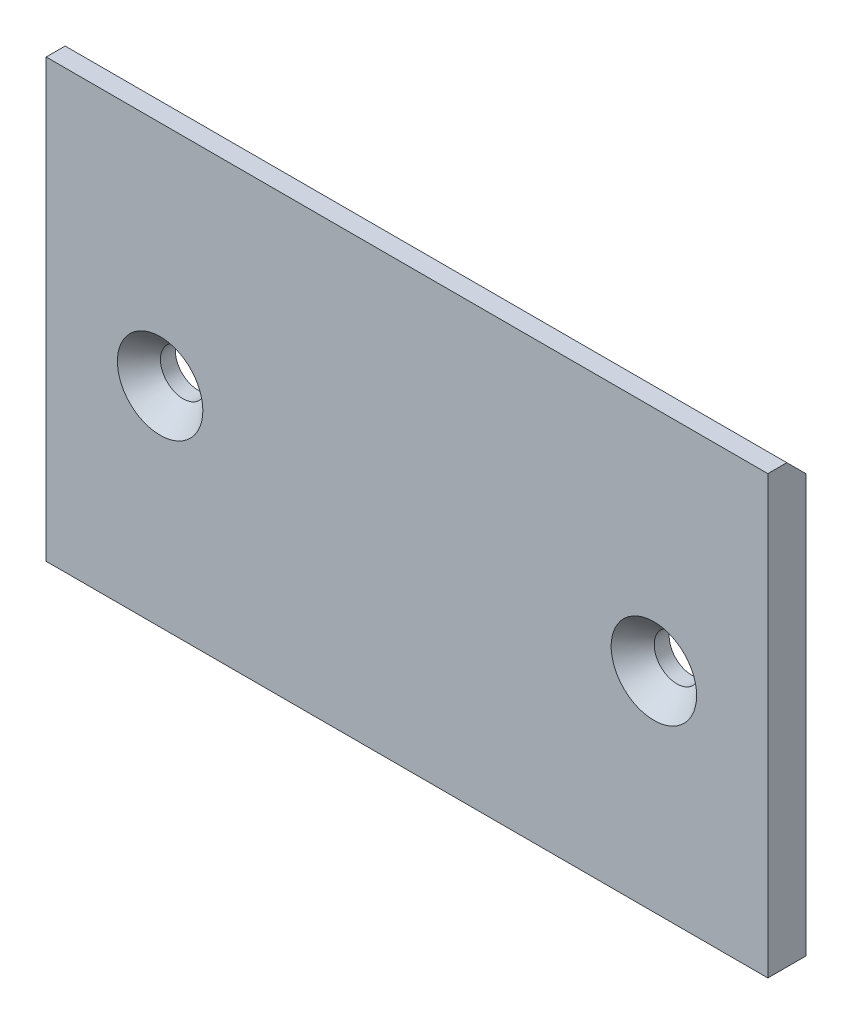
ISO-10303-21;
HEADER;
FILE_DESCRIPTION(('STEP AP214'),'2;1');
FILE_NAME('part.step','',(''),(''),'','','');
FILE_SCHEMA(('AUTOMOTIVE_DESIGN { 1 0 10303 214 1 1 1 1 }'));
ENDSEC;
DATA;
#1=APPLICATION_CONTEXT('core data for automotive mechanical design processes');
#2=APPLICATION_PROTOCOL_DEFINITION('international standard','automotive_design',2000,#1);
#3=PRODUCT_CONTEXT('',#1,'mechanical');
#4=PRODUCT('Part','Part','',(#3));
#5=PRODUCT_RELATED_PRODUCT_CATEGORY('part','',(#4));
#6=PRODUCT_DEFINITION_FORMATION('','',#4);
#7=PRODUCT_DEFINITION_CONTEXT('part definition',#1,'design');
#8=PRODUCT_DEFINITION('design','',#6,#7);
#9=PRODUCT_DEFINITION_SHAPE('','',#8);
#10=(LENGTH_UNIT() NAMED_UNIT(*) SI_UNIT(.MILLI.,.METRE.));
#11=(NAMED_UNIT(*) PLANE_ANGLE_UNIT() SI_UNIT($,.RADIAN.));
#12=(NAMED_UNIT(*) SI_UNIT($,.STERADIAN.) SOLID_ANGLE_UNIT());
#13=UNCERTAINTY_MEASURE_WITH_UNIT(LENGTH_MEASURE(1.E-05),#10,'distance_accuracy_value','');
#14=(GEOMETRIC_REPRESENTATION_CONTEXT(3) GLOBAL_UNCERTAINTY_ASSIGNED_CONTEXT((#13)) GLOBAL_UNIT_ASSIGNED_CONTEXT((#10,
#11,#12)) REPRESENTATION_CONTEXT('',''));
#15=CARTESIAN_POINT('',(0.,0.,0.));
#16=DIRECTION('',(0.,0.,1.));
#17=DIRECTION('',(1.,0.,0.));
#18=AXIS2_PLACEMENT_3D('',#15,#16,#17);
#19=CARTESIAN_POINT('',(-30.1625,18.25625,1.5875));
#20=DIRECTION('',(1.,0.,0.));
#21=DIRECTION('',(0.,1.,0.));
#22=AXIS2_PLACEMENT_3D('',#19,#20,#21);
#23=PLANE('',#22);
#24=DIRECTION('',(0.,0.,-1.));
#25=VECTOR('',#24,1.);
#26=CARTESIAN_POINT('',(-30.1625,18.25625,1.5875));
#27=LINE('',#26,#25);
#28=CARTESIAN_POINT('',(-30.1625,18.25625,1.5875));
#29=VERTEX_POINT('',#28);
#30=CARTESIAN_POINT('',(-30.1625,18.25625,0.));
#31=VERTEX_POINT('',#30);
#32=EDGE_CURVE('E127',#29,#31,#27,.T.);
#33=ORIENTED_EDGE('',*,*,#32,.T.);
#34=DIRECTION('',(0.,0.707106781186549,0.707106781186546));
#35=VECTOR('',#34,1.);
#36=CARTESIAN_POINT('',(-30.1625,18.25625,0.));
#37=LINE('',#36,#35);
#38=CARTESIAN_POINT('',(-30.1625,16.66875,-1.5875));
#39=VERTEX_POINT('',#38);
#40=EDGE_CURVE('E56',#31,#39,#37,.F.);
#41=ORIENTED_EDGE('',*,*,#40,.T.);
#42=DIRECTION('',(0.,-1.,0.));
#43=VECTOR('',#42,1.);
#44=CARTESIAN_POINT('',(-30.1625,18.25625,-1.5875));
#45=LINE('',#44,#43);
#46=CARTESIAN_POINT('',(-30.1625,-18.25625,-1.5875));
#47=VERTEX_POINT('',#46);
#48=EDGE_CURVE('E99',#39,#47,#45,.T.);
#49=ORIENTED_EDGE('',*,*,#48,.T.);
#50=DIRECTION('',(0.,0.,-1.));
#51=VECTOR('',#50,1.);
#52=CARTESIAN_POINT('',(-30.1625,-18.25625,1.5875));
#53=LINE('',#52,#51);
#54=CARTESIAN_POINT('',(-30.1625,-18.25625,1.5875));
#55=VERTEX_POINT('',#54);
#56=EDGE_CURVE('E84',#55,#47,#53,.T.);
#57=ORIENTED_EDGE('',*,*,#56,.F.);
#58=DIRECTION('',(0.,-1.,0.));
#59=VECTOR('',#58,1.);
#60=CARTESIAN_POINT('',(-30.1625,18.25625,1.5875));
#61=LINE('',#60,#59);
#62=EDGE_CURVE('E90',#29,#55,#61,.T.);
#63=ORIENTED_EDGE('',*,*,#62,.F.);
#64=EDGE_LOOP('',(#33,#41,#49,#57,#63));
#65=FACE_BOUND('',#64,.T.);
#66=ADVANCED_FACE('F32',(#65),#23,.F.);
#67=CARTESIAN_POINT('',(-30.1625,-18.25625,1.5875));
#68=DIRECTION('',(0.,1.,0.));
#69=DIRECTION('',(0.,0.,1.));
#70=AXIS2_PLACEMENT_3D('',#67,#68,#69);
#71=PLANE('',#70);
#72=DIRECTION('',(1.,0.,0.));
#73=VECTOR('',#72,1.);
#74=CARTESIAN_POINT('',(-30.1625,-18.25625,-1.5875));
#75=LINE('',#74,#73);
#76=CARTESIAN_POINT('',(30.1625,-18.25625,-1.5875));
#77=VERTEX_POINT('',#76);
#78=EDGE_CURVE('E115',#47,#77,#75,.T.);
#79=ORIENTED_EDGE('',*,*,#78,.T.);
#80=DIRECTION('',(0.,0.,-1.));
#81=VECTOR('',#80,1.);
#82=CARTESIAN_POINT('',(30.1625,-18.25625,1.5875));
#83=LINE('',#82,#81);
#84=CARTESIAN_POINT('',(30.1625,-18.25625,1.5875));
#85=VERTEX_POINT('',#84);
#86=EDGE_CURVE('E86',#85,#77,#83,.T.);
#87=ORIENTED_EDGE('',*,*,#86,.F.);
#88=DIRECTION('',(1.,0.,0.));
#89=VECTOR('',#88,1.);
#90=CARTESIAN_POINT('',(-30.1625,-18.25625,1.5875));
#91=LINE('',#90,#89);
#92=EDGE_CURVE('E80',#55,#85,#91,.T.);
#93=ORIENTED_EDGE('',*,*,#92,.F.);
#94=ORIENTED_EDGE('',*,*,#56,.T.);
#95=EDGE_LOOP('',(#79,#87,#93,#94));
#96=FACE_BOUND('',#95,.T.);
#97=ADVANCED_FACE('F82',(#96),#71,.F.);
#98=CARTESIAN_POINT('',(30.1625,18.25625,1.5875));
#99=DIRECTION('',(-1.,0.,0.));
#100=DIRECTION('',(0.,-1.,0.));
#101=AXIS2_PLACEMENT_3D('',#98,#99,#100);
#102=PLANE('',#101);
#103=DIRECTION('',(0.,1.,0.));
#104=VECTOR('',#103,1.);
#105=CARTESIAN_POINT('',(30.1625,18.25625,-1.5875));
#106=LINE('',#105,#104);
#107=CARTESIAN_POINT('',(30.1625,16.66875,-1.5875));
#108=VERTEX_POINT('',#107);
#109=EDGE_CURVE('E97',#77,#108,#106,.T.);
#110=ORIENTED_EDGE('',*,*,#109,.T.);
#111=DIRECTION('',(0.,-0.707106781186549,-0.707106781186546));
#112=VECTOR('',#111,1.);
#113=CARTESIAN_POINT('',(30.1625,18.25625,0.));
#114=LINE('',#113,#112);
#115=CARTESIAN_POINT('',(30.1625,18.25625,0.));
#116=VERTEX_POINT('',#115);
#117=EDGE_CURVE('E11',#108,#116,#114,.F.);
#118=ORIENTED_EDGE('',*,*,#117,.T.);
#119=DIRECTION('',(0.,0.,-1.));
#120=VECTOR('',#119,1.);
#121=CARTESIAN_POINT('',(30.1625,18.25625,1.5875));
#122=LINE('',#121,#120);
#123=CARTESIAN_POINT('',(30.1625,18.25625,1.5875));
#124=VERTEX_POINT('',#123);
#125=EDGE_CURVE('E105',#124,#116,#122,.T.);
#126=ORIENTED_EDGE('',*,*,#125,.F.);
#127=DIRECTION('',(0.,1.,0.));
#128=VECTOR('',#127,1.);
#129=CARTESIAN_POINT('',(30.1625,18.25625,1.5875));
#130=LINE('',#129,#128);
#131=EDGE_CURVE('E89',#85,#124,#130,.T.);
#132=ORIENTED_EDGE('',*,*,#131,.F.);
#133=ORIENTED_EDGE('',*,*,#86,.T.);
#134=EDGE_LOOP('',(#110,#118,#126,#132,#133));
#135=FACE_BOUND('',#134,.T.);
#136=ADVANCED_FACE('F139',(#135),#102,.F.);
#137=CARTESIAN_POINT('',(-30.1625,18.25625,1.5875));
#138=DIRECTION('',(0.,-1.,0.));
#139=DIRECTION('',(0.,0.,-1.));
#140=AXIS2_PLACEMENT_3D('',#137,#138,#139);
#141=PLANE('',#140);
#142=ORIENTED_EDGE('',*,*,#125,.T.);
#143=DIRECTION('',(-1.,0.,0.));
#144=VECTOR('',#143,1.);
#145=CARTESIAN_POINT('',(-30.1625,18.25625,0.));
#146=LINE('',#145,#144);
#147=EDGE_CURVE('E101',#116,#31,#146,.T.);
#148=ORIENTED_EDGE('',*,*,#147,.T.);
#149=ORIENTED_EDGE('',*,*,#32,.F.);
#150=DIRECTION('',(-1.,0.,0.));
#151=VECTOR('',#150,1.);
#152=CARTESIAN_POINT('',(-30.1625,18.25625,1.5875));
#153=LINE('',#152,#151);
#154=EDGE_CURVE('E95',#124,#29,#153,.T.);
#155=ORIENTED_EDGE('',*,*,#154,.F.);
#156=EDGE_LOOP('',(#142,#148,#149,#155));
#157=FACE_BOUND('',#156,.T.);
#158=ADVANCED_FACE('F135',(#157),#141,.F.);
#159=CARTESIAN_POINT('',(-30.1625,18.25625,1.5875));
#160=DIRECTION('',(0.,0.,1.));
#161=DIRECTION('',(1.,0.,0.));
#162=AXIS2_PLACEMENT_3D('',#159,#160,#161);
#163=PLANE('',#162);
#164=CARTESIAN_POINT('',(-20.6375,-0.793750000000003,1.5875));
#165=DIRECTION('',(0.,0.,1.));
#166=DIRECTION('',(1.,0.,0.));
#167=AXIS2_PLACEMENT_3D('',#164,#165,#166);
#168=CIRCLE('',#167,3.571875);
#169=CARTESIAN_POINT('',(-17.065625,-0.793750000000003,1.5875));
#170=VERTEX_POINT('',#169);
#171=EDGE_CURVE('E224',#170,#170,#168,.T.);
#172=ORIENTED_EDGE('',*,*,#171,.F.);
#173=EDGE_LOOP('',(#172));
#174=FACE_BOUND('',#173,.T.);
#175=CARTESIAN_POINT('',(20.6375,-0.793750000000003,1.5875));
#176=DIRECTION('',(0.,0.,1.));
#177=DIRECTION('',(1.,0.,0.));
#178=AXIS2_PLACEMENT_3D('',#175,#176,#177);
#179=CIRCLE('',#178,3.571875);
#180=CARTESIAN_POINT('',(24.209375,-0.793750000000003,1.5875));
#181=VERTEX_POINT('',#180);
#182=EDGE_CURVE('E118',#181,#181,#179,.T.);
#183=ORIENTED_EDGE('',*,*,#182,.F.);
#184=EDGE_LOOP('',(#183));
#185=FACE_BOUND('',#184,.T.);
#186=ORIENTED_EDGE('',*,*,#62,.T.);
#187=ORIENTED_EDGE('',*,*,#92,.T.);
#188=ORIENTED_EDGE('',*,*,#131,.T.);
#189=ORIENTED_EDGE('',*,*,#154,.T.);
#190=EDGE_LOOP('',(#186,#187,#188,#189));
#191=FACE_BOUND('',#190,.T.);
#192=ADVANCED_FACE('F93',(#174,#185,#191),#163,.T.);
#193=CARTESIAN_POINT('',(-30.1625,18.25625,-1.5875));
#194=DIRECTION('',(0.,0.,1.));
#195=DIRECTION('',(1.,0.,0.));
#196=AXIS2_PLACEMENT_3D('',#193,#194,#195);
#197=PLANE('',#196);
#198=CARTESIAN_POINT('',(-20.6375,-0.793750000000003,-1.5875));
#199=DIRECTION('',(0.,0.,1.));
#200=DIRECTION('',(1.,0.,0.));
#201=AXIS2_PLACEMENT_3D('',#198,#199,#200);
#202=CIRCLE('',#201,1.89864999999999);
#203=CARTESIAN_POINT('',(-18.73885,-0.793750000000003,-1.5875));
#204=VERTEX_POINT('',#203);
#205=EDGE_CURVE('E36',#204,#204,#202,.T.);
#206=ORIENTED_EDGE('',*,*,#205,.T.);
#207=EDGE_LOOP('',(#206));
#208=FACE_BOUND('',#207,.T.);
#209=CARTESIAN_POINT('',(20.6375,-0.793750000000003,-1.5875));
#210=DIRECTION('',(0.,0.,1.));
#211=DIRECTION('',(1.,0.,0.));
#212=AXIS2_PLACEMENT_3D('',#209,#210,#211);
#213=CIRCLE('',#212,1.89864999999999);
#214=CARTESIAN_POINT('',(22.53615,-0.793750000000003,-1.5875));
#215=VERTEX_POINT('',#214);
#216=EDGE_CURVE('E110',#215,#215,#213,.T.);
#217=ORIENTED_EDGE('',*,*,#216,.T.);
#218=EDGE_LOOP('',(#217));
#219=FACE_BOUND('',#218,.T.);
#220=ORIENTED_EDGE('',*,*,#48,.F.);
#221=DIRECTION('',(1.,0.,0.));
#222=VECTOR('',#221,1.);
#223=CARTESIAN_POINT('',(-30.1625,16.66875,-1.5875));
#224=LINE('',#223,#222);
#225=EDGE_CURVE('E41',#39,#108,#224,.T.);
#226=ORIENTED_EDGE('',*,*,#225,.T.);
#227=ORIENTED_EDGE('',*,*,#109,.F.);
#228=ORIENTED_EDGE('',*,*,#78,.F.);
#229=EDGE_LOOP('',(#220,#226,#227,#228));
#230=FACE_BOUND('',#229,.T.);
#231=ADVANCED_FACE('F140',(#208,#219,#230),#197,.F.);
#232=CARTESIAN_POINT('',(-30.1625,18.25625,0.));
#233=DIRECTION('',(0.,-0.707106781186546,0.707106781186549));
#234=DIRECTION('',(0.,-0.707106781186549,-0.707106781186546));
#235=AXIS2_PLACEMENT_3D('',#232,#233,#234);
#236=PLANE('',#235);
#237=ORIENTED_EDGE('',*,*,#117,.F.);
#238=ORIENTED_EDGE('',*,*,#225,.F.);
#239=ORIENTED_EDGE('',*,*,#40,.F.);
#240=ORIENTED_EDGE('',*,*,#147,.F.);
#241=EDGE_LOOP('',(#237,#238,#239,#240));
#242=FACE_BOUND('',#241,.T.);
#243=ADVANCED_FACE('F34',(#242),#236,.F.);
#244=CARTESIAN_POINT('',(20.6375,-0.793750000000003,1.5875));
#245=DIRECTION('',(0.,0.,1.));
#246=DIRECTION('',(1.,0.,0.));
#247=AXIS2_PLACEMENT_3D('',#244,#245,#246);
#248=CYLINDRICAL_SURFACE('',#247,1.89864999999999);
#249=CARTESIAN_POINT('',(20.6375,-0.793750000000003,-0.337325178172381));
#250=DIRECTION('',(0.,0.,1.));
#251=DIRECTION('',(1.,0.,0.));
#252=AXIS2_PLACEMENT_3D('',#249,#250,#251);
#253=CIRCLE('',#252,1.89864999999999);
#254=CARTESIAN_POINT('',(22.53615,-0.793750000000003,-0.337325178172381));
#255=VERTEX_POINT('',#254);
#256=EDGE_CURVE('E112',#255,#255,#253,.T.);
#257=ORIENTED_EDGE('',*,*,#256,.T.);
#258=EDGE_LOOP('',(#257));
#259=FACE_BOUND('',#258,.T.);
#260=ORIENTED_EDGE('',*,*,#216,.F.);
#261=EDGE_LOOP('',(#260));
#262=FACE_BOUND('',#261,.T.);
#263=ADVANCED_FACE('F148',(#259,#262),#248,.F.);
#264=CARTESIAN_POINT('',(20.6375,-0.793750000000003,1.5875));
#265=DIRECTION('',(0.,0.,1.));
#266=DIRECTION('',(1.,0.,0.));
#267=AXIS2_PLACEMENT_3D('',#264,#265,#266);
#268=CONICAL_SURFACE('',#267,3.571875,0.715584993317674);
#269=ORIENTED_EDGE('',*,*,#256,.F.);
#270=EDGE_LOOP('',(#269));
#271=FACE_BOUND('',#270,.T.);
#272=ORIENTED_EDGE('',*,*,#182,.T.);
#273=EDGE_LOOP('',(#272));
#274=FACE_BOUND('',#273,.T.);
#275=ADVANCED_FACE('F185',(#271,#274),#268,.F.);
#276=CARTESIAN_POINT('',(-20.6375,-0.793750000000003,1.5875));
#277=DIRECTION('',(0.,0.,1.));
#278=DIRECTION('',(1.,0.,0.));
#279=AXIS2_PLACEMENT_3D('',#276,#277,#278);
#280=CYLINDRICAL_SURFACE('',#279,1.89864999999999);
#281=CARTESIAN_POINT('',(-20.6375,-0.793750000000003,-0.337325178172381));
#282=DIRECTION('',(0.,0.,1.));
#283=DIRECTION('',(1.,0.,0.));
#284=AXIS2_PLACEMENT_3D('',#281,#282,#283);
#285=CIRCLE('',#284,1.89864999999999);
#286=CARTESIAN_POINT('',(-18.73885,-0.793750000000003,-0.337325178172381));
#287=VERTEX_POINT('',#286);
#288=EDGE_CURVE('E221',#287,#287,#285,.T.);
#289=ORIENTED_EDGE('',*,*,#288,.T.);
#290=EDGE_LOOP('',(#289));
#291=FACE_BOUND('',#290,.T.);
#292=ORIENTED_EDGE('',*,*,#205,.F.);
#293=EDGE_LOOP('',(#292));
#294=FACE_BOUND('',#293,.T.);
#295=ADVANCED_FACE('F194',(#291,#294),#280,.F.);
#296=CARTESIAN_POINT('',(-20.6375,-0.793750000000003,1.5875));
#297=DIRECTION('',(0.,0.,1.));
#298=DIRECTION('',(1.,0.,0.));
#299=AXIS2_PLACEMENT_3D('',#296,#297,#298);
#300=CONICAL_SURFACE('',#299,3.571875,0.715584993317674);
#301=ORIENTED_EDGE('',*,*,#288,.F.);
#302=EDGE_LOOP('',(#301));
#303=FACE_BOUND('',#302,.T.);
#304=ORIENTED_EDGE('',*,*,#171,.T.);
#305=EDGE_LOOP('',(#304));
#306=FACE_BOUND('',#305,.T.);
#307=ADVANCED_FACE('F204',(#303,#306),#300,.F.);
#308=CLOSED_SHELL('',(#66,#97,#136,#158,#192,#231,#243,#263,#275,#295,#307));
#309=MANIFOLD_SOLID_BREP('B2',#308);
#310=ADVANCED_BREP_SHAPE_REPRESENTATION('',(#18,#309),#14);
#311=SHAPE_DEFINITION_REPRESENTATION(#9,#310);
ENDSEC;
END-ISO-10303-21;
